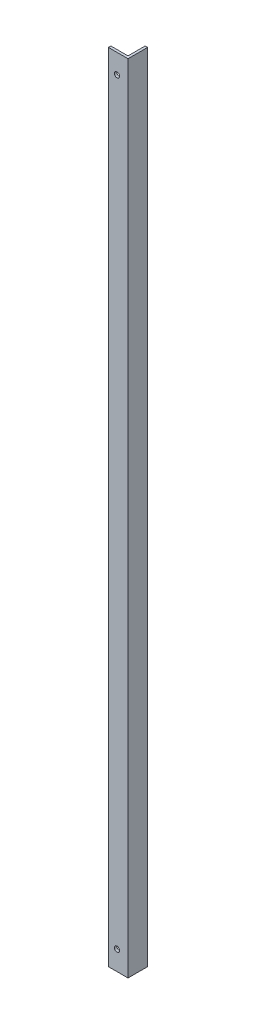
ISO-10303-21;
HEADER;
FILE_DESCRIPTION(('STEP AP214'),'2;1');
FILE_NAME('part.step','',(''),(''),'','','');
FILE_SCHEMA(('AUTOMOTIVE_DESIGN { 1 0 10303 214 1 1 1 1 }'));
ENDSEC;
DATA;
#1=APPLICATION_CONTEXT('core data for automotive mechanical design processes');
#2=APPLICATION_PROTOCOL_DEFINITION('international standard','automotive_design',2000,#1);
#3=PRODUCT_CONTEXT('',#1,'mechanical');
#4=PRODUCT('Part','Part','',(#3));
#5=PRODUCT_RELATED_PRODUCT_CATEGORY('part','',(#4));
#6=PRODUCT_DEFINITION_FORMATION('','',#4);
#7=PRODUCT_DEFINITION_CONTEXT('part definition',#1,'design');
#8=PRODUCT_DEFINITION('design','',#6,#7);
#9=PRODUCT_DEFINITION_SHAPE('','',#8);
#10=(LENGTH_UNIT() NAMED_UNIT(*) SI_UNIT(.MILLI.,.METRE.));
#11=(NAMED_UNIT(*) PLANE_ANGLE_UNIT() SI_UNIT($,.RADIAN.));
#12=(NAMED_UNIT(*) SI_UNIT($,.STERADIAN.) SOLID_ANGLE_UNIT());
#13=UNCERTAINTY_MEASURE_WITH_UNIT(LENGTH_MEASURE(1.E-05),#10,'distance_accuracy_value','');
#14=(GEOMETRIC_REPRESENTATION_CONTEXT(3) GLOBAL_UNCERTAINTY_ASSIGNED_CONTEXT((#13)) GLOBAL_UNIT_ASSIGNED_CONTEXT((#10,
#11,#12)) REPRESENTATION_CONTEXT('',''));
#15=CARTESIAN_POINT('',(0.,0.,0.));
#16=DIRECTION('',(0.,0.,1.));
#17=DIRECTION('',(1.,0.,0.));
#18=AXIS2_PLACEMENT_3D('',#15,#16,#17);
#19=CARTESIAN_POINT('',(-1314.74985259558,330.2,0.453057921452893));
#20=DIRECTION('',(0.,-1.,0.));
#21=DIRECTION('',(0.964326147917118,0.,-0.26471698178117));
#22=AXIS2_PLACEMENT_3D('',#19,#20,#21);
#23=PLANE('',#22);
#24=DIRECTION('',(1.,0.,0.));
#25=VECTOR('',#24,1.);
#26=CARTESIAN_POINT('',(-1315.75025594941,330.2,-25.3999999999994));
#27=LINE('',#26,#25);
#28=CARTESIAN_POINT('',(-1317.92485259558,330.2,-25.3999999999995));
#29=VERTEX_POINT('',#28);
#30=CARTESIAN_POINT('',(-1314.74985259558,330.2,-25.3999999999993));
#31=VERTEX_POINT('',#30);
#32=EDGE_CURVE('E191',#29,#31,#27,.T.);
#33=ORIENTED_EDGE('',*,*,#32,.T.);
#34=DIRECTION('',(0.,0.,1.));
#35=VECTOR('',#34,1.);
#36=CARTESIAN_POINT('',(-1314.74985259558,330.2,-4.83961884029349));
#37=LINE('',#36,#35);
#38=CARTESIAN_POINT('',(-1314.74985259558,330.2,1.66533453693773E-13));
#39=VERTEX_POINT('',#38);
#40=EDGE_CURVE('E137',#31,#39,#37,.T.);
#41=ORIENTED_EDGE('',*,*,#40,.T.);
#42=DIRECTION('',(-1.,0.,0.));
#43=VECTOR('',#42,1.);
#44=CARTESIAN_POINT('',(-1480.98408110292,330.2,0.));
#45=LINE('',#44,#43);
#46=CARTESIAN_POINT('',(-1340.14985259558,330.2,4.9960036108132E-13));
#47=VERTEX_POINT('',#46);
#48=EDGE_CURVE('E116',#39,#47,#45,.T.);
#49=ORIENTED_EDGE('',*,*,#48,.T.);
#50=DIRECTION('',(0.,0.,-1.));
#51=VECTOR('',#50,1.);
#52=CARTESIAN_POINT('',(-1340.14985259558,330.2,-0.889515630805637));
#53=LINE('',#52,#51);
#54=CARTESIAN_POINT('',(-1340.14985259558,330.2,-3.17499999999965));
#55=VERTEX_POINT('',#54);
#56=EDGE_CURVE('E127',#47,#55,#53,.T.);
#57=ORIENTED_EDGE('',*,*,#56,.T.);
#58=DIRECTION('',(1.,0.,0.));
#59=VECTOR('',#58,1.);
#60=CARTESIAN_POINT('',(-1336.47817261185,330.2,-3.17499999999959));
#61=LINE('',#60,#59);
#62=CARTESIAN_POINT('',(-1317.92485259558,330.2,-3.17499999999959));
#63=VERTEX_POINT('',#62);
#64=EDGE_CURVE('E133',#55,#63,#61,.T.);
#65=ORIENTED_EDGE('',*,*,#64,.T.);
#66=DIRECTION('',(0.,0.,-1.));
#67=VECTOR('',#66,1.);
#68=CARTESIAN_POINT('',(-1317.92485259558,330.2,-21.4481556932714));
#69=LINE('',#68,#67);
#70=EDGE_CURVE('E194',#63,#29,#69,.T.);
#71=ORIENTED_EDGE('',*,*,#70,.T.);
#72=EDGE_LOOP('',(#33,#41,#49,#57,#65,#71));
#73=FACE_BOUND('',#72,.T.);
#74=ADVANCED_FACE('F42',(#73),#23,.T.);
#75=CARTESIAN_POINT('',(-1314.74985259558,-3046.63179568099,-4.83961884029355));
#76=DIRECTION('',(-1.,0.,0.));
#77=DIRECTION('',(0.,0.,1.));
#78=AXIS2_PLACEMENT_3D('',#75,#76,#77);
#79=PLANE('',#78);
#80=ORIENTED_EDGE('',*,*,#40,.F.);
#81=DIRECTION('',(0.,1.,0.));
#82=VECTOR('',#81,1.);
#83=CARTESIAN_POINT('',(-1314.74985259558,-3046.63179568099,-25.3999999999994));
#84=LINE('',#83,#82);
#85=CARTESIAN_POINT('',(-1314.74985259558,1365.25,-25.3999999999994));
#86=VERTEX_POINT('',#85);
#87=EDGE_CURVE('E63',#31,#86,#84,.T.);
#88=ORIENTED_EDGE('',*,*,#87,.T.);
#89=DIRECTION('',(0.,0.,1.));
#90=VECTOR('',#89,1.);
#91=CARTESIAN_POINT('',(-1314.74985259558,1365.25,-4.83961884029355));
#92=LINE('',#91,#90);
#93=CARTESIAN_POINT('',(-1314.74985259558,1365.25,1.66533453693773E-13));
#94=VERTEX_POINT('',#93);
#95=EDGE_CURVE('E11',#86,#94,#92,.T.);
#96=ORIENTED_EDGE('',*,*,#95,.T.);
#97=DIRECTION('',(0.,1.,0.));
#98=VECTOR('',#97,1.);
#99=CARTESIAN_POINT('',(-1314.74985259558,-3046.63179568099,1.66533453693773E-13));
#100=LINE('',#99,#98);
#101=EDGE_CURVE('E123',#39,#94,#100,.T.);
#102=ORIENTED_EDGE('',*,*,#101,.F.);
#103=EDGE_LOOP('',(#80,#88,#96,#102));
#104=FACE_BOUND('',#103,.T.);
#105=ADVANCED_FACE('F209',(#104),#79,.F.);
#106=CARTESIAN_POINT('',(-1315.75025594941,-3046.63179568099,-25.3999999999994));
#107=DIRECTION('',(0.,0.,1.));
#108=DIRECTION('',(1.,0.,0.));
#109=AXIS2_PLACEMENT_3D('',#106,#107,#108);
#110=PLANE('',#109);
#111=ORIENTED_EDGE('',*,*,#32,.F.);
#112=DIRECTION('',(0.,1.,0.));
#113=VECTOR('',#112,1.);
#114=CARTESIAN_POINT('',(-1317.92485259558,-3046.63179568099,-25.3999999999995));
#115=LINE('',#114,#113);
#116=CARTESIAN_POINT('',(-1317.92485259558,1365.25,-25.3999999999995));
#117=VERTEX_POINT('',#116);
#118=EDGE_CURVE('E72',#29,#117,#115,.T.);
#119=ORIENTED_EDGE('',*,*,#118,.T.);
#120=DIRECTION('',(1.,0.,0.));
#121=VECTOR('',#120,1.);
#122=CARTESIAN_POINT('',(-1315.75025594941,1365.25,-25.3999999999993));
#123=LINE('',#122,#121);
#124=EDGE_CURVE('E52',#117,#86,#123,.T.);
#125=ORIENTED_EDGE('',*,*,#124,.T.);
#126=ORIENTED_EDGE('',*,*,#87,.F.);
#127=EDGE_LOOP('',(#111,#119,#125,#126));
#128=FACE_BOUND('',#127,.T.);
#129=ADVANCED_FACE('F207',(#128),#110,.F.);
#130=CARTESIAN_POINT('',(-1317.92485259558,-3046.63179568099,-21.4481556932714));
#131=DIRECTION('',(1.,0.,0.));
#132=DIRECTION('',(0.,0.,-1.));
#133=AXIS2_PLACEMENT_3D('',#130,#131,#132);
#134=PLANE('',#133);
#135=ORIENTED_EDGE('',*,*,#70,.F.);
#136=DIRECTION('',(0.,1.,0.));
#137=VECTOR('',#136,1.);
#138=CARTESIAN_POINT('',(-1317.92485259558,-3046.63179568099,-3.17499999999965));
#139=LINE('',#138,#137);
#140=CARTESIAN_POINT('',(-1317.92485259558,1365.25,-3.17499999999965));
#141=VERTEX_POINT('',#140);
#142=EDGE_CURVE('E154',#63,#141,#139,.T.);
#143=ORIENTED_EDGE('',*,*,#142,.T.);
#144=DIRECTION('',(0.,0.,-1.));
#145=VECTOR('',#144,1.);
#146=CARTESIAN_POINT('',(-1317.92485259558,1365.25,-21.4481556932713));
#147=LINE('',#146,#145);
#148=EDGE_CURVE('E184',#141,#117,#147,.T.);
#149=ORIENTED_EDGE('',*,*,#148,.T.);
#150=ORIENTED_EDGE('',*,*,#118,.F.);
#151=EDGE_LOOP('',(#135,#143,#149,#150));
#152=FACE_BOUND('',#151,.T.);
#153=ADVANCED_FACE('F205',(#152),#134,.F.);
#154=CARTESIAN_POINT('',(-1336.47817261185,-3046.63179568099,-3.17499999999954));
#155=DIRECTION('',(0.,0.,1.));
#156=DIRECTION('',(1.,0.,0.));
#157=AXIS2_PLACEMENT_3D('',#154,#155,#156);
#158=PLANE('',#157);
#159=CARTESIAN_POINT('',(-1329.03735259558,355.6,-3.17499999999954));
#160=DIRECTION('',(0.,0.,1.));
#161=DIRECTION('',(1.,0.,0.));
#162=AXIS2_PLACEMENT_3D('',#159,#160,#161);
#163=CIRCLE('',#162,3.3782);
#164=CARTESIAN_POINT('',(-1325.65915259558,355.6,-3.17499999999954));
#165=VERTEX_POINT('',#164);
#166=EDGE_CURVE('E162',#165,#165,#163,.F.);
#167=ORIENTED_EDGE('',*,*,#166,.F.);
#168=EDGE_LOOP('',(#167));
#169=FACE_BOUND('',#168,.T.);
#170=CARTESIAN_POINT('',(-1329.03735259558,1339.85,-3.17499999999954));
#171=DIRECTION('',(0.,0.,1.));
#172=DIRECTION('',(1.,0.,0.));
#173=AXIS2_PLACEMENT_3D('',#170,#171,#172);
#174=CIRCLE('',#173,3.3782);
#175=CARTESIAN_POINT('',(-1325.65915259558,1339.85,-3.17499999999954));
#176=VERTEX_POINT('',#175);
#177=EDGE_CURVE('E139',#176,#176,#174,.F.);
#178=ORIENTED_EDGE('',*,*,#177,.F.);
#179=EDGE_LOOP('',(#178));
#180=FACE_BOUND('',#179,.T.);
#181=ORIENTED_EDGE('',*,*,#64,.F.);
#182=DIRECTION('',(0.,1.,0.));
#183=VECTOR('',#182,1.);
#184=CARTESIAN_POINT('',(-1340.14985259558,-3046.63179568099,-3.17499999999965));
#185=LINE('',#184,#183);
#186=CARTESIAN_POINT('',(-1340.14985259558,1365.25,-3.17499999999965));
#187=VERTEX_POINT('',#186);
#188=EDGE_CURVE('E124',#55,#187,#185,.T.);
#189=ORIENTED_EDGE('',*,*,#188,.T.);
#190=DIRECTION('',(1.,0.,0.));
#191=VECTOR('',#190,1.);
#192=CARTESIAN_POINT('',(-1336.47817261185,1365.25,-3.17499999999965));
#193=LINE('',#192,#191);
#194=EDGE_CURVE('E180',#187,#141,#193,.T.);
#195=ORIENTED_EDGE('',*,*,#194,.T.);
#196=ORIENTED_EDGE('',*,*,#142,.F.);
#197=EDGE_LOOP('',(#181,#189,#195,#196));
#198=FACE_BOUND('',#197,.T.);
#199=ADVANCED_FACE('F201',(#169,#180,#198),#158,.F.);
#200=CARTESIAN_POINT('',(-1340.14985259558,-3046.63179568099,-0.889515630805637));
#201=DIRECTION('',(1.,0.,0.));
#202=DIRECTION('',(0.,0.,-1.));
#203=AXIS2_PLACEMENT_3D('',#200,#201,#202);
#204=PLANE('',#203);
#205=ORIENTED_EDGE('',*,*,#56,.F.);
#206=DIRECTION('',(0.,1.,0.));
#207=VECTOR('',#206,1.);
#208=CARTESIAN_POINT('',(-1340.14985259558,-3046.63179568099,4.9960036108132E-13));
#209=LINE('',#208,#207);
#210=CARTESIAN_POINT('',(-1340.14985259558,1365.25,4.9960036108132E-13));
#211=VERTEX_POINT('',#210);
#212=EDGE_CURVE('E113',#47,#211,#209,.T.);
#213=ORIENTED_EDGE('',*,*,#212,.T.);
#214=DIRECTION('',(0.,0.,-1.));
#215=VECTOR('',#214,1.);
#216=CARTESIAN_POINT('',(-1340.14985259558,1365.25,-0.889515630805582));
#217=LINE('',#216,#215);
#218=EDGE_CURVE('E178',#211,#187,#217,.T.);
#219=ORIENTED_EDGE('',*,*,#218,.T.);
#220=ORIENTED_EDGE('',*,*,#188,.F.);
#221=EDGE_LOOP('',(#205,#213,#219,#220));
#222=FACE_BOUND('',#221,.T.);
#223=ADVANCED_FACE('F128',(#222),#204,.F.);
#224=CARTESIAN_POINT('',(-1480.98408110292,-3046.63179568099,0.));
#225=DIRECTION('',(0.,0.,-1.));
#226=DIRECTION('',(-1.,0.,0.));
#227=AXIS2_PLACEMENT_3D('',#224,#225,#226);
#228=PLANE('',#227);
#229=CARTESIAN_POINT('',(-1329.03735259558,355.6,2.22044604925031E-13));
#230=DIRECTION('',(0.,0.,-1.));
#231=DIRECTION('',(-1.,0.,0.));
#232=AXIS2_PLACEMENT_3D('',#229,#230,#231);
#233=CIRCLE('',#232,3.3782);
#234=CARTESIAN_POINT('',(-1332.41555259558,355.6,2.20356854985226E-13));
#235=VERTEX_POINT('',#234);
#236=EDGE_CURVE('E46',#235,#235,#233,.F.);
#237=ORIENTED_EDGE('',*,*,#236,.F.);
#238=EDGE_LOOP('',(#237));
#239=FACE_BOUND('',#238,.T.);
#240=CARTESIAN_POINT('',(-1329.03735259558,1339.85,1.66533453693773E-13));
#241=DIRECTION('',(0.,0.,-1.));
#242=DIRECTION('',(-1.,0.,0.));
#243=AXIS2_PLACEMENT_3D('',#240,#241,#242);
#244=CIRCLE('',#243,3.3782);
#245=CARTESIAN_POINT('',(-1332.41555259558,1339.85,1.64845703753969E-13));
#246=VERTEX_POINT('',#245);
#247=EDGE_CURVE('E146',#246,#246,#244,.F.);
#248=ORIENTED_EDGE('',*,*,#247,.F.);
#249=EDGE_LOOP('',(#248));
#250=FACE_BOUND('',#249,.T.);
#251=ORIENTED_EDGE('',*,*,#48,.F.);
#252=ORIENTED_EDGE('',*,*,#101,.T.);
#253=DIRECTION('',(-1.,0.,0.));
#254=VECTOR('',#253,1.);
#255=CARTESIAN_POINT('',(-1480.98408110292,1365.25,0.));
#256=LINE('',#255,#254);
#257=EDGE_CURVE('E118',#94,#211,#256,.T.);
#258=ORIENTED_EDGE('',*,*,#257,.T.);
#259=ORIENTED_EDGE('',*,*,#212,.F.);
#260=EDGE_LOOP('',(#251,#252,#258,#259));
#261=FACE_BOUND('',#260,.T.);
#262=ADVANCED_FACE('F44',(#239,#250,#261),#228,.F.);
#263=CARTESIAN_POINT('',(-1476.1211207883,1365.25,11.3650697175547));
#264=DIRECTION('',(0.,1.,0.));
#265=DIRECTION('',(-0.964326147917118,0.,0.26471698178117));
#266=AXIS2_PLACEMENT_3D('',#263,#264,#265);
#267=PLANE('',#266);
#268=ORIENTED_EDGE('',*,*,#95,.F.);
#269=ORIENTED_EDGE('',*,*,#124,.F.);
#270=ORIENTED_EDGE('',*,*,#148,.F.);
#271=ORIENTED_EDGE('',*,*,#194,.F.);
#272=ORIENTED_EDGE('',*,*,#218,.F.);
#273=ORIENTED_EDGE('',*,*,#257,.F.);
#274=EDGE_LOOP('',(#268,#269,#270,#271,#272,#273));
#275=FACE_BOUND('',#274,.T.);
#276=ADVANCED_FACE('F211',(#275),#267,.T.);
#277=CARTESIAN_POINT('',(-1329.03735259558,1339.85,-3553.21699062703));
#278=DIRECTION('',(0.,0.,1.));
#279=DIRECTION('',(1.,0.,0.));
#280=AXIS2_PLACEMENT_3D('',#277,#278,#279);
#281=CYLINDRICAL_SURFACE('',#280,3.3782);
#282=ORIENTED_EDGE('',*,*,#247,.T.);
#283=EDGE_LOOP('',(#282));
#284=FACE_BOUND('',#283,.T.);
#285=ORIENTED_EDGE('',*,*,#177,.T.);
#286=EDGE_LOOP('',(#285));
#287=FACE_BOUND('',#286,.T.);
#288=ADVANCED_FACE('F213',(#284,#287),#281,.F.);
#289=CARTESIAN_POINT('',(-1329.03735259558,355.6,-3553.21699062703));
#290=DIRECTION('',(0.,0.,1.));
#291=DIRECTION('',(1.,0.,0.));
#292=AXIS2_PLACEMENT_3D('',#289,#290,#291);
#293=CYLINDRICAL_SURFACE('',#292,3.3782);
#294=ORIENTED_EDGE('',*,*,#236,.T.);
#295=EDGE_LOOP('',(#294));
#296=FACE_BOUND('',#295,.T.);
#297=ORIENTED_EDGE('',*,*,#166,.T.);
#298=EDGE_LOOP('',(#297));
#299=FACE_BOUND('',#298,.T.);
#300=ADVANCED_FACE('F219',(#296,#299),#293,.F.);
#301=CLOSED_SHELL('',(#74,#105,#129,#153,#199,#223,#262,#276,#288,#300));
#302=MANIFOLD_SOLID_BREP('B2',#301);
#303=ADVANCED_BREP_SHAPE_REPRESENTATION('',(#18,#302),#14);
#304=SHAPE_DEFINITION_REPRESENTATION(#9,#303);
ENDSEC;
END-ISO-10303-21;
